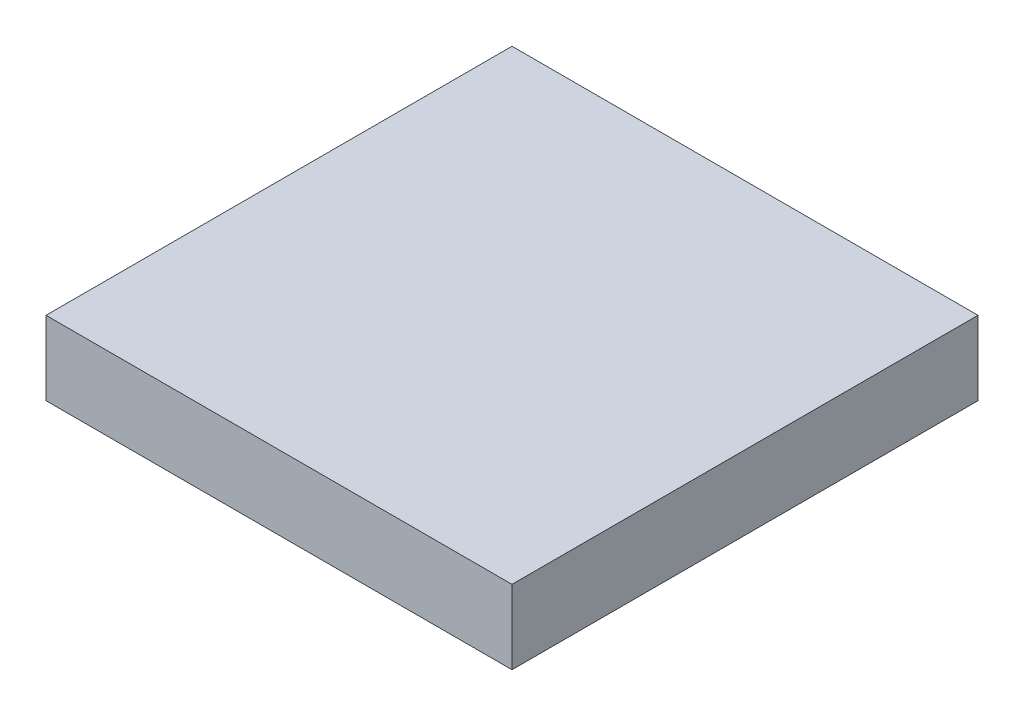
ISO-10303-21;
HEADER;
FILE_DESCRIPTION(('STEP AP214'),'2;1');
FILE_NAME('part.step','',(''),(''),'','','');
FILE_SCHEMA(('AUTOMOTIVE_DESIGN { 1 0 10303 214 1 1 1 1 }'));
ENDSEC;
DATA;
#1=APPLICATION_CONTEXT('core data for automotive mechanical design processes');
#2=APPLICATION_PROTOCOL_DEFINITION('international standard','automotive_design',2000,#1);
#3=PRODUCT_CONTEXT('',#1,'mechanical');
#4=PRODUCT('Part','Part','',(#3));
#5=PRODUCT_RELATED_PRODUCT_CATEGORY('part','',(#4));
#6=PRODUCT_DEFINITION_FORMATION('','',#4);
#7=PRODUCT_DEFINITION_CONTEXT('part definition',#1,'design');
#8=PRODUCT_DEFINITION('design','',#6,#7);
#9=PRODUCT_DEFINITION_SHAPE('','',#8);
#10=(LENGTH_UNIT() NAMED_UNIT(*) SI_UNIT(.MILLI.,.METRE.));
#11=(NAMED_UNIT(*) PLANE_ANGLE_UNIT() SI_UNIT($,.RADIAN.));
#12=(NAMED_UNIT(*) SI_UNIT($,.STERADIAN.) SOLID_ANGLE_UNIT());
#13=UNCERTAINTY_MEASURE_WITH_UNIT(LENGTH_MEASURE(1.E-05),#10,'distance_accuracy_value','');
#14=(GEOMETRIC_REPRESENTATION_CONTEXT(3) GLOBAL_UNCERTAINTY_ASSIGNED_CONTEXT((#13)) GLOBAL_UNIT_ASSIGNED_CONTEXT((#10,
#11,#12)) REPRESENTATION_CONTEXT('',''));
#15=CARTESIAN_POINT('',(0.,0.,0.));
#16=DIRECTION('',(0.,0.,1.));
#17=DIRECTION('',(1.,0.,0.));
#18=AXIS2_PLACEMENT_3D('',#15,#16,#17);
#19=CARTESIAN_POINT('',(0.,12.7,0.));
#20=DIRECTION('',(1.,0.,0.));
#21=DIRECTION('',(0.,0.,-1.));
#22=AXIS2_PLACEMENT_3D('',#19,#20,#21);
#23=PLANE('',#22);
#24=DIRECTION('',(0.,0.,1.));
#25=VECTOR('',#24,1.);
#26=CARTESIAN_POINT('',(0.,0.,0.));
#27=LINE('',#26,#25);
#28=CARTESIAN_POINT('',(0.,0.,0.));
#29=VERTEX_POINT('',#28);
#30=CARTESIAN_POINT('',(0.,0.,80.01));
#31=VERTEX_POINT('',#30);
#32=EDGE_CURVE('E96',#29,#31,#27,.T.);
#33=ORIENTED_EDGE('',*,*,#32,.T.);
#34=DIRECTION('',(0.,-1.,0.));
#35=VECTOR('',#34,1.);
#36=CARTESIAN_POINT('',(0.,12.7,80.01));
#37=LINE('',#36,#35);
#38=CARTESIAN_POINT('',(0.,12.7,80.01));
#39=VERTEX_POINT('',#38);
#40=EDGE_CURVE('E11',#39,#31,#37,.T.);
#41=ORIENTED_EDGE('',*,*,#40,.F.);
#42=DIRECTION('',(0.,0.,1.));
#43=VECTOR('',#42,1.);
#44=CARTESIAN_POINT('',(0.,12.7,0.));
#45=LINE('',#44,#43);
#46=CARTESIAN_POINT('',(0.,12.7,0.));
#47=VERTEX_POINT('',#46);
#48=EDGE_CURVE('E84',#47,#39,#45,.T.);
#49=ORIENTED_EDGE('',*,*,#48,.F.);
#50=DIRECTION('',(0.,-1.,0.));
#51=VECTOR('',#50,1.);
#52=CARTESIAN_POINT('',(0.,12.7,0.));
#53=LINE('',#52,#51);
#54=EDGE_CURVE('E92',#47,#29,#53,.T.);
#55=ORIENTED_EDGE('',*,*,#54,.T.);
#56=EDGE_LOOP('',(#33,#41,#49,#55));
#57=FACE_BOUND('',#56,.T.);
#58=ADVANCED_FACE('F33',(#57),#23,.F.);
#59=CARTESIAN_POINT('',(0.,12.7,80.01));
#60=DIRECTION('',(0.,0.,-1.));
#61=DIRECTION('',(-1.,0.,0.));
#62=AXIS2_PLACEMENT_3D('',#59,#60,#61);
#63=PLANE('',#62);
#64=DIRECTION('',(1.,0.,0.));
#65=VECTOR('',#64,1.);
#66=CARTESIAN_POINT('',(0.,0.,80.01));
#67=LINE('',#66,#65);
#68=CARTESIAN_POINT('',(80.01,0.,80.01));
#69=VERTEX_POINT('',#68);
#70=EDGE_CURVE('E88',#31,#69,#67,.T.);
#71=ORIENTED_EDGE('',*,*,#70,.T.);
#72=DIRECTION('',(0.,-1.,0.));
#73=VECTOR('',#72,1.);
#74=CARTESIAN_POINT('',(80.01,12.7,80.01));
#75=LINE('',#74,#73);
#76=CARTESIAN_POINT('',(80.01,12.7,80.01));
#77=VERTEX_POINT('',#76);
#78=EDGE_CURVE('E41',#77,#69,#75,.T.);
#79=ORIENTED_EDGE('',*,*,#78,.F.);
#80=DIRECTION('',(1.,0.,0.));
#81=VECTOR('',#80,1.);
#82=CARTESIAN_POINT('',(0.,12.7,80.01));
#83=LINE('',#82,#81);
#84=EDGE_CURVE('E79',#39,#77,#83,.T.);
#85=ORIENTED_EDGE('',*,*,#84,.F.);
#86=ORIENTED_EDGE('',*,*,#40,.T.);
#87=EDGE_LOOP('',(#71,#79,#85,#86));
#88=FACE_BOUND('',#87,.T.);
#89=ADVANCED_FACE('F87',(#88),#63,.F.);
#90=CARTESIAN_POINT('',(80.01,12.7,0.));
#91=DIRECTION('',(-1.,0.,0.));
#92=DIRECTION('',(0.,0.,1.));
#93=AXIS2_PLACEMENT_3D('',#90,#91,#92);
#94=PLANE('',#93);
#95=DIRECTION('',(0.,0.,-1.));
#96=VECTOR('',#95,1.);
#97=CARTESIAN_POINT('',(80.01,0.,0.));
#98=LINE('',#97,#96);
#99=CARTESIAN_POINT('',(80.01,0.,0.));
#100=VERTEX_POINT('',#99);
#101=EDGE_CURVE('E66',#69,#100,#98,.T.);
#102=ORIENTED_EDGE('',*,*,#101,.T.);
#103=DIRECTION('',(0.,-1.,0.));
#104=VECTOR('',#103,1.);
#105=CARTESIAN_POINT('',(80.01,12.7,0.));
#106=LINE('',#105,#104);
#107=CARTESIAN_POINT('',(80.01,12.7,0.));
#108=VERTEX_POINT('',#107);
#109=EDGE_CURVE('E89',#108,#100,#106,.T.);
#110=ORIENTED_EDGE('',*,*,#109,.F.);
#111=DIRECTION('',(0.,0.,-1.));
#112=VECTOR('',#111,1.);
#113=CARTESIAN_POINT('',(80.01,12.7,0.));
#114=LINE('',#113,#112);
#115=EDGE_CURVE('E82',#77,#108,#114,.T.);
#116=ORIENTED_EDGE('',*,*,#115,.F.);
#117=ORIENTED_EDGE('',*,*,#78,.T.);
#118=EDGE_LOOP('',(#102,#110,#116,#117));
#119=FACE_BOUND('',#118,.T.);
#120=ADVANCED_FACE('F90',(#119),#94,.F.);
#121=CARTESIAN_POINT('',(0.,12.7,0.));
#122=DIRECTION('',(0.,0.,1.));
#123=DIRECTION('',(1.,0.,0.));
#124=AXIS2_PLACEMENT_3D('',#121,#122,#123);
#125=PLANE('',#124);
#126=DIRECTION('',(-1.,0.,0.));
#127=VECTOR('',#126,1.);
#128=CARTESIAN_POINT('',(0.,0.,0.));
#129=LINE('',#128,#127);
#130=EDGE_CURVE('E72',#100,#29,#129,.T.);
#131=ORIENTED_EDGE('',*,*,#130,.T.);
#132=ORIENTED_EDGE('',*,*,#54,.F.);
#133=DIRECTION('',(-1.,0.,0.));
#134=VECTOR('',#133,1.);
#135=CARTESIAN_POINT('',(0.,12.7,0.));
#136=LINE('',#135,#134);
#137=EDGE_CURVE('E49',#108,#47,#136,.T.);
#138=ORIENTED_EDGE('',*,*,#137,.F.);
#139=ORIENTED_EDGE('',*,*,#109,.T.);
#140=EDGE_LOOP('',(#131,#132,#138,#139));
#141=FACE_BOUND('',#140,.T.);
#142=ADVANCED_FACE('F103',(#141),#125,.F.);
#143=CARTESIAN_POINT('',(0.,12.7,0.));
#144=DIRECTION('',(0.,1.,0.));
#145=DIRECTION('',(0.,0.,1.));
#146=AXIS2_PLACEMENT_3D('',#143,#144,#145);
#147=PLANE('',#146);
#148=ORIENTED_EDGE('',*,*,#48,.T.);
#149=ORIENTED_EDGE('',*,*,#84,.T.);
#150=ORIENTED_EDGE('',*,*,#115,.T.);
#151=ORIENTED_EDGE('',*,*,#137,.T.);
#152=EDGE_LOOP('',(#148,#149,#150,#151));
#153=FACE_BOUND('',#152,.T.);
#154=ADVANCED_FACE('F80',(#153),#147,.T.);
#155=CARTESIAN_POINT('',(0.,0.,0.));
#156=DIRECTION('',(0.,1.,0.));
#157=DIRECTION('',(0.,0.,1.));
#158=AXIS2_PLACEMENT_3D('',#155,#156,#157);
#159=PLANE('',#158);
#160=ORIENTED_EDGE('',*,*,#32,.F.);
#161=ORIENTED_EDGE('',*,*,#130,.F.);
#162=ORIENTED_EDGE('',*,*,#101,.F.);
#163=ORIENTED_EDGE('',*,*,#70,.F.);
#164=EDGE_LOOP('',(#160,#161,#162,#163));
#165=FACE_BOUND('',#164,.T.);
#166=ADVANCED_FACE('F106',(#165),#159,.F.);
#167=CLOSED_SHELL('',(#58,#89,#120,#142,#154,#166));
#168=MANIFOLD_SOLID_BREP('B2',#167);
#169=ADVANCED_BREP_SHAPE_REPRESENTATION('',(#18,#168),#14);
#170=SHAPE_DEFINITION_REPRESENTATION(#9,#169);
ENDSEC;
END-ISO-10303-21;
